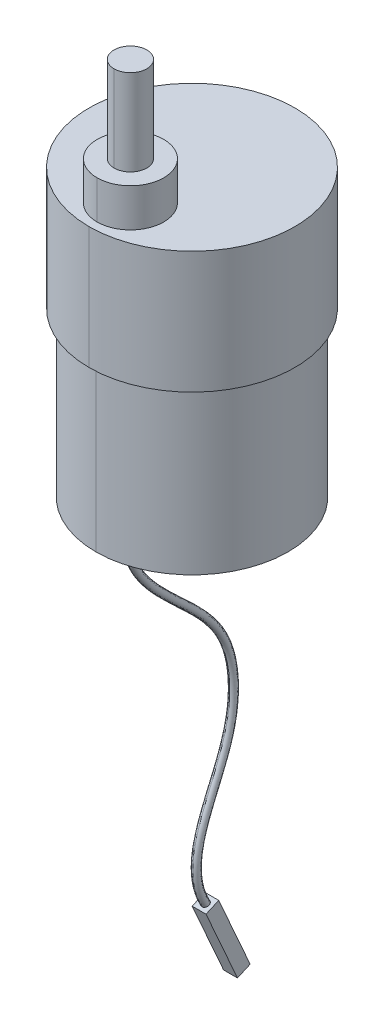
ISO-10303-21;
HEADER;
FILE_DESCRIPTION(('STEP AP214'),'2;1');
FILE_NAME('part.step','',(''),(''),'','','');
FILE_SCHEMA(('AUTOMOTIVE_DESIGN { 1 0 10303 214 1 1 1 1 }'));
ENDSEC;
DATA;
#1=APPLICATION_CONTEXT('core data for automotive mechanical design processes');
#2=APPLICATION_PROTOCOL_DEFINITION('international standard','automotive_design',2000,#1);
#3=PRODUCT_CONTEXT('',#1,'mechanical');
#4=PRODUCT('Part','Part','',(#3));
#5=PRODUCT_RELATED_PRODUCT_CATEGORY('part','',(#4));
#6=PRODUCT_DEFINITION_FORMATION('','',#4);
#7=PRODUCT_DEFINITION_CONTEXT('part definition',#1,'design');
#8=PRODUCT_DEFINITION('design','',#6,#7);
#9=PRODUCT_DEFINITION_SHAPE('','',#8);
#10=(LENGTH_UNIT() NAMED_UNIT(*) SI_UNIT(.MILLI.,.METRE.));
#11=(NAMED_UNIT(*) PLANE_ANGLE_UNIT() SI_UNIT($,.RADIAN.));
#12=(NAMED_UNIT(*) SI_UNIT($,.STERADIAN.) SOLID_ANGLE_UNIT());
#13=UNCERTAINTY_MEASURE_WITH_UNIT(LENGTH_MEASURE(1.E-05),#10,'distance_accuracy_value','');
#14=(GEOMETRIC_REPRESENTATION_CONTEXT(3) GLOBAL_UNCERTAINTY_ASSIGNED_CONTEXT((#13)) GLOBAL_UNIT_ASSIGNED_CONTEXT((#10,
#11,#12)) REPRESENTATION_CONTEXT('',''));
#15=CARTESIAN_POINT('',(0.,0.,0.));
#16=DIRECTION('',(0.,0.,1.));
#17=DIRECTION('',(1.,0.,0.));
#18=AXIS2_PLACEMENT_3D('',#15,#16,#17);
#19=CARTESIAN_POINT('',(0.,-55.0147326261418,-24.3537346097616));
#20=DIRECTION('',(0.,-0.914410504016221,-0.404788129945532));
#21=DIRECTION('',(0.,0.404788129945532,-0.914410504016221));
#22=AXIS2_PLACEMENT_3D('',#19,#20,#21);
#23=PLANE('',#22);
#24=CARTESIAN_POINT('',(0.,-64.7223606920733,-2.42434385967983));
#25=DIRECTION('',(0.,-0.914410504016226,-0.40478812994552));
#26=DIRECTION('',(0.,0.40478812994552,-0.914410504016226));
#27=AXIS2_PLACEMENT_3D('',#24,#25,#26);
#28=CIRCLE('',#27,0.65);
#29=CARTESIAN_POINT('',(0.,-64.4592484076087,-3.01871068729037));
#30=VERTEX_POINT('',#29);
#31=CARTESIAN_POINT('',(0.,-64.9854729765379,-1.82997703206929));
#32=VERTEX_POINT('',#31);
#33=EDGE_CURVE('E256',#30,#32,#28,.T.);
#34=ORIENTED_EDGE('',*,*,#33,.T.);
#35=CARTESIAN_POINT('',(0.,-64.7223606920733,-2.42434385967983));
#36=DIRECTION('',(0.,-0.914410504016226,-0.40478812994552));
#37=DIRECTION('',(0.,0.40478812994552,-0.914410504016226));
#38=AXIS2_PLACEMENT_3D('',#35,#36,#37);
#39=CIRCLE('',#38,0.65);
#40=EDGE_CURVE('E140',#32,#30,#39,.T.);
#41=ORIENTED_EDGE('',*,*,#40,.T.);
#42=EDGE_LOOP('',(#34,#41));
#43=FACE_BOUND('',#42,.T.);
#44=DIRECTION('',(-1.,0.,0.));
#45=VECTOR('',#44,1.);
#46=CARTESIAN_POINT('',(1.25,-65.2283458545052,-1.28133072965957));
#47=LINE('',#46,#45);
#48=CARTESIAN_POINT('',(1.25,-65.2283458545052,-1.28133072965957));
#49=VERTEX_POINT('',#48);
#50=CARTESIAN_POINT('',(-1.25,-65.2283458545052,-1.28133072965957));
#51=VERTEX_POINT('',#50);
#52=EDGE_CURVE('E207',#49,#51,#47,.T.);
#53=ORIENTED_EDGE('',*,*,#52,.F.);
#54=DIRECTION('',(0.,-0.404788129945532,0.914410504016221));
#55=VECTOR('',#54,1.);
#56=CARTESIAN_POINT('',(1.25,-64.2163755296414,-3.56735698970013));
#57=LINE('',#56,#55);
#58=CARTESIAN_POINT('',(1.25,-64.2163755296414,-3.56735698970013));
#59=VERTEX_POINT('',#58);
#60=EDGE_CURVE('E28',#59,#49,#57,.T.);
#61=ORIENTED_EDGE('',*,*,#60,.F.);
#62=DIRECTION('',(1.,0.,0.));
#63=VECTOR('',#62,1.);
#64=CARTESIAN_POINT('',(-1.25,-64.2163755296414,-3.56735698970013));
#65=LINE('',#64,#63);
#66=CARTESIAN_POINT('',(-1.25,-64.2163755296414,-3.56735698970013));
#67=VERTEX_POINT('',#66);
#68=EDGE_CURVE('E250',#67,#59,#65,.T.);
#69=ORIENTED_EDGE('',*,*,#68,.F.);
#70=DIRECTION('',(0.,0.404788129945532,-0.914410504016221));
#71=VECTOR('',#70,1.);
#72=CARTESIAN_POINT('',(-1.25,-65.2283458545052,-1.28133072965957));
#73=LINE('',#72,#71);
#74=EDGE_CURVE('E221',#51,#67,#73,.T.);
#75=ORIENTED_EDGE('',*,*,#74,.F.);
#76=EDGE_LOOP('',(#53,#61,#69,#75));
#77=FACE_BOUND('',#76,.T.);
#78=ADVANCED_FACE('F15',(#43,#77),#23,.F.);
#79=CARTESIAN_POINT('',(0.,-67.8164796823689,-30.020768428999));
#80=DIRECTION('',(0.,-0.914410504016221,-0.404788129945532));
#81=DIRECTION('',(0.,0.404788129945532,-0.914410504016221));
#82=AXIS2_PLACEMENT_3D('',#79,#80,#81);
#83=PLANE('',#82);
#84=DIRECTION('',(-1.,0.,0.));
#85=VECTOR('',#84,1.);
#86=CARTESIAN_POINT('',(1.25,-78.0300929107323,-6.94836454889697));
#87=LINE('',#86,#85);
#88=CARTESIAN_POINT('',(1.25,-78.0300929107323,-6.94836454889697));
#89=VERTEX_POINT('',#88);
#90=CARTESIAN_POINT('',(-1.25,-78.0300929107323,-6.94836454889697));
#91=VERTEX_POINT('',#90);
#92=EDGE_CURVE('E269',#89,#91,#87,.T.);
#93=ORIENTED_EDGE('',*,*,#92,.T.);
#94=DIRECTION('',(0.,0.404788129945532,-0.914410504016221));
#95=VECTOR('',#94,1.);
#96=CARTESIAN_POINT('',(-1.25,-78.0300929107323,-6.94836454889697));
#97=LINE('',#96,#95);
#98=CARTESIAN_POINT('',(-1.25,-77.0181225858685,-9.23439080893753));
#99=VERTEX_POINT('',#98);
#100=EDGE_CURVE('E232',#91,#99,#97,.T.);
#101=ORIENTED_EDGE('',*,*,#100,.T.);
#102=DIRECTION('',(1.,0.,0.));
#103=VECTOR('',#102,1.);
#104=CARTESIAN_POINT('',(-1.25,-77.0181225858685,-9.23439080893753));
#105=LINE('',#104,#103);
#106=CARTESIAN_POINT('',(1.25,-77.0181225858685,-9.23439080893753));
#107=VERTEX_POINT('',#106);
#108=EDGE_CURVE('E21',#99,#107,#105,.T.);
#109=ORIENTED_EDGE('',*,*,#108,.T.);
#110=DIRECTION('',(0.,-0.404788129945532,0.914410504016221));
#111=VECTOR('',#110,1.);
#112=CARTESIAN_POINT('',(1.25,-77.0181225858685,-9.23439080893753));
#113=LINE('',#112,#111);
#114=EDGE_CURVE('E10',#107,#89,#113,.T.);
#115=ORIENTED_EDGE('',*,*,#114,.T.);
#116=EDGE_LOOP('',(#93,#101,#109,#115));
#117=FACE_BOUND('',#116,.T.);
#118=ADVANCED_FACE('F348',(#117),#83,.T.);
#119=CARTESIAN_POINT('',(1.25,-77.0181225858685,-9.23439080893753));
#120=DIRECTION('',(-1.,0.,0.));
#121=DIRECTION('',(0.,0.,1.));
#122=AXIS2_PLACEMENT_3D('',#119,#120,#121);
#123=PLANE('',#122);
#124=ORIENTED_EDGE('',*,*,#60,.T.);
#125=DIRECTION('',(0.,0.914410504016222,0.404788129945528));
#126=VECTOR('',#125,1.);
#127=CARTESIAN_POINT('',(1.25,-78.0300929107323,-6.94836454889697));
#128=LINE('',#127,#126);
#129=EDGE_CURVE('E226',#89,#49,#128,.T.);
#130=ORIENTED_EDGE('',*,*,#129,.F.);
#131=ORIENTED_EDGE('',*,*,#114,.F.);
#132=DIRECTION('',(0.,0.914410504016222,0.404788129945528));
#133=VECTOR('',#132,1.);
#134=CARTESIAN_POINT('',(1.25,-77.0181225858685,-9.23439080893753));
#135=LINE('',#134,#133);
#136=EDGE_CURVE('E270',#107,#59,#135,.T.);
#137=ORIENTED_EDGE('',*,*,#136,.T.);
#138=EDGE_LOOP('',(#124,#130,#131,#137));
#139=FACE_BOUND('',#138,.T.);
#140=ADVANCED_FACE('F354',(#139),#123,.F.);
#141=CARTESIAN_POINT('',(-1.25,-77.0181225858685,-9.23439080893753));
#142=DIRECTION('',(0.,-0.404788129945528,0.914410504016222));
#143=DIRECTION('',(-1.,0.,0.));
#144=AXIS2_PLACEMENT_3D('',#141,#142,#143);
#145=PLANE('',#144);
#146=ORIENTED_EDGE('',*,*,#68,.T.);
#147=ORIENTED_EDGE('',*,*,#136,.F.);
#148=ORIENTED_EDGE('',*,*,#108,.F.);
#149=DIRECTION('',(0.,0.914410504016222,0.404788129945528));
#150=VECTOR('',#149,1.);
#151=CARTESIAN_POINT('',(-1.25,-77.0181225858685,-9.23439080893753));
#152=LINE('',#151,#150);
#153=EDGE_CURVE('E225',#99,#67,#152,.T.);
#154=ORIENTED_EDGE('',*,*,#153,.T.);
#155=EDGE_LOOP('',(#146,#147,#148,#154));
#156=FACE_BOUND('',#155,.T.);
#157=ADVANCED_FACE('F570',(#156),#145,.F.);
#158=CARTESIAN_POINT('',(-1.25,-78.0300929107323,-6.94836454889697));
#159=DIRECTION('',(1.,0.,0.));
#160=DIRECTION('',(0.,0.,1.));
#161=AXIS2_PLACEMENT_3D('',#158,#159,#160);
#162=PLANE('',#161);
#163=ORIENTED_EDGE('',*,*,#74,.T.);
#164=ORIENTED_EDGE('',*,*,#153,.F.);
#165=ORIENTED_EDGE('',*,*,#100,.F.);
#166=DIRECTION('',(0.,0.914410504016222,0.404788129945528));
#167=VECTOR('',#166,1.);
#168=CARTESIAN_POINT('',(-1.25,-78.0300929107323,-6.94836454889697));
#169=LINE('',#168,#167);
#170=EDGE_CURVE('E211',#91,#51,#169,.T.);
#171=ORIENTED_EDGE('',*,*,#170,.T.);
#172=EDGE_LOOP('',(#163,#164,#165,#171));
#173=FACE_BOUND('',#172,.T.);
#174=ADVANCED_FACE('F382',(#173),#162,.F.);
#175=CARTESIAN_POINT('',(1.25,-78.0300929107323,-6.94836454889697));
#176=DIRECTION('',(0.,0.404788129945528,-0.914410504016222));
#177=DIRECTION('',(-1.,0.,0.));
#178=AXIS2_PLACEMENT_3D('',#175,#176,#177);
#179=PLANE('',#178);
#180=ORIENTED_EDGE('',*,*,#52,.T.);
#181=ORIENTED_EDGE('',*,*,#170,.F.);
#182=ORIENTED_EDGE('',*,*,#92,.F.);
#183=ORIENTED_EDGE('',*,*,#129,.T.);
#184=EDGE_LOOP('',(#180,#181,#182,#183));
#185=FACE_BOUND('',#184,.T.);
#186=ADVANCED_FACE('F369',(#185),#179,.F.);
#187=CARTESIAN_POINT('',(0.,0.,12.65));
#188=CARTESIAN_POINT('',(0.,-2.94508597447817,12.4221320995553));
#189=CARTESIAN_POINT('',(0.,-5.4510477209894,11.4643707065353));
#190=CARTESIAN_POINT('',(0.,-9.86280286559184,8.73518139959936));
#191=CARTESIAN_POINT('',(0.,-11.7739584150813,6.96988376922254));
#192=CARTESIAN_POINT('',(0.,-17.2037332541465,1.40262029181695));
#193=CARTESIAN_POINT('',(0.,-20.4365862628114,-2.65453861440402));
#194=CARTESIAN_POINT('',(0.,-28.8274141781325,-6.94249034266679));
#195=CARTESIAN_POINT('',(0.,-34.1326729879684,-7.31428293315415));
#196=CARTESIAN_POINT('',(0.,-43.4025857579736,-5.14712333658673));
#197=CARTESIAN_POINT('',(0.,-47.5323174776611,-2.86793592251471));
#198=CARTESIAN_POINT('',(0.,-53.8521649333888,-0.675203239836204));
#199=CARTESIAN_POINT('',(0.,-55.9866849765013,-0.150542574307158));
#200=CARTESIAN_POINT('',(0.,-60.3947273715979,-0.098549934723846));
#201=CARTESIAN_POINT('',(0.,-62.6646128417333,-0.580780996059781));
#202=CARTESIAN_POINT('',(0.,-64.9854729765379,-1.82997703206929));
#203=CARTESIAN_POINT('',(-1.3,0.,12.65));
#204=CARTESIAN_POINT('',(-1.3,-2.94508597447817,12.4221320995553));
#205=CARTESIAN_POINT('',(-1.3,-5.45104772098939,11.4643707065353));
#206=CARTESIAN_POINT('',(-1.3,-9.86280286559183,8.73518139959935));
#207=CARTESIAN_POINT('',(-1.3,-11.7739584150813,6.96988376922255));
#208=CARTESIAN_POINT('',(-1.3,-17.2037332541465,1.40262029181695));
#209=CARTESIAN_POINT('',(-1.3,-20.4365862628114,-2.65453861440402));
#210=CARTESIAN_POINT('',(-1.3,-28.8274141781325,-6.94249034266678));
#211=CARTESIAN_POINT('',(-1.3,-34.1326729879684,-7.31428293315415));
#212=CARTESIAN_POINT('',(-1.3,-43.4025857579736,-5.14712333658673));
#213=CARTESIAN_POINT('',(-1.3,-47.5323174776611,-2.86793592251471));
#214=CARTESIAN_POINT('',(-1.3,-53.8521649333887,-0.675203239836204));
#215=CARTESIAN_POINT('',(-1.3,-55.9866849765013,-0.150542574307158));
#216=CARTESIAN_POINT('',(-1.3,-60.3947273715979,-0.0985499347238459));
#217=CARTESIAN_POINT('',(-1.3,-62.6646128417332,-0.58078099605978));
#218=CARTESIAN_POINT('',(-1.3,-64.9854729765379,-1.82997703206929));
#219=CARTESIAN_POINT('',(-1.3,0.,11.35));
#220=CARTESIAN_POINT('',(-1.3,-2.72297593374063,11.1221320993654));
#221=CARTESIAN_POINT('',(-1.3,-5.00215693324374,10.2331416397973));
#222=CARTESIAN_POINT('',(-1.3,-9.11955441032927,7.65582525360883));
#223=CARTESIAN_POINT('',(-1.3,-10.9524087292984,5.96136903183279));
#224=CARTESIAN_POINT('',(-1.3,-16.2800223976183,0.483413186728767));
#225=CARTESIAN_POINT('',(-1.3,-19.5859068972608,-3.71085119959601));
#226=CARTESIAN_POINT('',(-1.3,-28.6874121097851,-8.29004479228079));
#227=CARTESIAN_POINT('',(-1.3,-34.2758885455149,-8.63404704726913));
#228=CARTESIAN_POINT('',(-1.3,-44.0308335983493,-6.31042850093244));
#229=CARTESIAN_POINT('',(-1.3,-48.2019362741022,-3.99388933417028));
#230=CARTESIAN_POINT('',(-1.3,-54.2995445510352,-1.8984740934069));
#231=CARTESIAN_POINT('',(-1.3,-56.2985437731357,-1.4279924247951));
#232=CARTESIAN_POINT('',(-1.3,-60.3124856434885,-1.41094100634713));
#233=CARTESIAN_POINT('',(-1.3,-62.3310651711934,-1.85480820556681));
#234=CARTESIAN_POINT('',(-1.3,-64.4592484076086,-3.01871068729037));
#235=CARTESIAN_POINT('',(0.,0.,11.35));
#236=CARTESIAN_POINT('',(0.,-2.72297593374063,11.1221320993654));
#237=CARTESIAN_POINT('',(0.,-5.00215693324374,10.2331416397973));
#238=CARTESIAN_POINT('',(0.,-9.11955441032927,7.65582525360884));
#239=CARTESIAN_POINT('',(0.,-10.9524087292985,5.9613690318328));
#240=CARTESIAN_POINT('',(0.,-16.2800223976183,0.483413186728767));
#241=CARTESIAN_POINT('',(0.,-19.5859068972608,-3.710851199596));
#242=CARTESIAN_POINT('',(0.,-28.6874121097851,-8.2900447922808));
#243=CARTESIAN_POINT('',(0.,-34.275888545515,-8.63404704726914));
#244=CARTESIAN_POINT('',(0.,-44.0308335983493,-6.31042850093243));
#245=CARTESIAN_POINT('',(0.,-48.2019362741023,-3.99388933417028));
#246=CARTESIAN_POINT('',(0.,-54.2995445510352,-1.8984740934069));
#247=CARTESIAN_POINT('',(0.,-56.2985437731357,-1.4279924247951));
#248=CARTESIAN_POINT('',(0.,-60.3124856434886,-1.41094100634713));
#249=CARTESIAN_POINT('',(0.,-62.3310651711935,-1.8548082055668));
#250=CARTESIAN_POINT('',(0.,-64.4592484076087,-3.01871068729037));
#251=(BOUNDED_SURFACE() B_SPLINE_SURFACE(3,3,((#187,#188,#189,#190,#191,#192,#193,#194,#195,
#196,#197,#198,#199,#200,#201,#202),(#203,#204,#205,#206,#207,#208,#209,#210,#211,#212,#213,
#214,#215,#216,#217,#218),(#219,#220,#221,#222,#223,#224,#225,#226,#227,#228,#229,#230,#231,
#232,#233,#234),(#235,#236,#237,#238,#239,#240,#241,#242,#243,#244,#245,#246,#247,#248,#249,
#250)),.UNSPECIFIED.,.F.,.F.,.F.) B_SPLINE_SURFACE_WITH_KNOTS((4,4),(4,2,2,2,2,2,2,4),(0.5,1.),
(0.,0.105175367804045,0.210350735608091,0.420701471216182,0.628255178213897,0.814127589106948,
0.907063794553474,1.),
.UNSPECIFIED.) GEOMETRIC_REPRESENTATION_ITEM() RATIONAL_B_SPLINE_SURFACE(((1.,1.,1.,1.,1.,1.,1.,
1.,1.,1.,1.,1.,1.,1.,1.,1.),(0.333333333333334,0.333333333333334,0.333333333333334,
0.333333333333334,0.333333333333334,0.333333333333334,0.333333333333334,0.333333333333334,
0.333333333333334,0.333333333333334,0.333333333333334,0.333333333333334,0.333333333333334,
0.333333333333334,0.333333333333334,0.333333333333334),(0.333333333333334,0.333333333333334,
0.333333333333334,0.333333333333334,0.333333333333334,0.333333333333334,0.333333333333334,
0.333333333333334,0.333333333333334,0.333333333333334,0.333333333333334,0.333333333333334,
0.333333333333334,0.333333333333334,0.333333333333334,0.333333333333334),(1.,1.,1.,1.,1.,1.,1.,
1.,1.,1.,1.,1.,1.,1.,1.,1.))) REPRESENTATION_ITEM('') SURFACE());
#252=CARTESIAN_POINT('',(0.,0.,12.65));
#253=CARTESIAN_POINT('',(0.,-2.94508597447817,12.4221320995553));
#254=CARTESIAN_POINT('',(0.,-5.4510477209894,11.4643707065353));
#255=CARTESIAN_POINT('',(0.,-9.86280286559184,8.73518139959936));
#256=CARTESIAN_POINT('',(0.,-11.7739584150813,6.96988376922254));
#257=CARTESIAN_POINT('',(0.,-17.2037332541465,1.40262029181695));
#258=CARTESIAN_POINT('',(0.,-20.4365862628114,-2.65453861440402));
#259=CARTESIAN_POINT('',(0.,-28.8274141781325,-6.94249034266679));
#260=CARTESIAN_POINT('',(0.,-34.1326729879684,-7.31428293315415));
#261=CARTESIAN_POINT('',(0.,-43.4025857579736,-5.14712333658673));
#262=CARTESIAN_POINT('',(0.,-47.5323174776611,-2.86793592251471));
#263=CARTESIAN_POINT('',(0.,-53.8521649333888,-0.675203239836204));
#264=CARTESIAN_POINT('',(0.,-55.9866849765013,-0.150542574307158));
#265=CARTESIAN_POINT('',(0.,-60.3947273715979,-0.098549934723846));
#266=CARTESIAN_POINT('',(0.,-62.6646128417333,-0.580780996059781));
#267=CARTESIAN_POINT('',(0.,-64.9854729765379,-1.82997703206929));
#268=(BOUNDED_CURVE() B_SPLINE_CURVE(3,(#252,#253,#254,#255,#256,#257,#258,#259,#260,#261,#262,
#263,#264,#265,#266,#267),.UNSPECIFIED.,.F.,.F.) B_SPLINE_CURVE_WITH_KNOTS((4,2,2,2,2,2,2,4),
(0.,0.105175367804045,0.210350735608091,0.420701471216182,0.628255178213897,0.814127589106948,
0.907063794553474,1.),
.UNSPECIFIED.) CURVE() GEOMETRIC_REPRESENTATION_ITEM() RATIONAL_B_SPLINE_CURVE((1.,1.,1.,1.,1.,
1.,1.,1.,1.,1.,1.,1.,1.,1.,1.,1.)) REPRESENTATION_ITEM(''));
#269=CARTESIAN_POINT('',(0.,0.,12.65));
#270=VERTEX_POINT('',#269);
#271=EDGE_CURVE('E251',#270,#32,#268,.T.);
#272=CARTESIAN_POINT('',(0.,0.,12.));
#273=DIRECTION('',(0.,-1.,0.));
#274=DIRECTION('',(0.,0.,-1.));
#275=AXIS2_PLACEMENT_3D('',#272,#273,#274);
#276=CIRCLE('',#275,0.65);
#277=CARTESIAN_POINT('',(0.,0.,11.35));
#278=VERTEX_POINT('',#277);
#279=EDGE_CURVE('E151',#270,#278,#276,.T.);
#280=CARTESIAN_POINT('',(0.,0.,11.35));
#281=CARTESIAN_POINT('',(0.,-2.72297593374063,11.1221320993654));
#282=CARTESIAN_POINT('',(0.,-5.00215693324374,10.2331416397973));
#283=CARTESIAN_POINT('',(0.,-9.11955441032927,7.65582525360884));
#284=CARTESIAN_POINT('',(0.,-10.9524087292985,5.9613690318328));
#285=CARTESIAN_POINT('',(0.,-16.2800223976183,0.483413186728767));
#286=CARTESIAN_POINT('',(0.,-19.5859068972608,-3.710851199596));
#287=CARTESIAN_POINT('',(0.,-28.6874121097851,-8.2900447922808));
#288=CARTESIAN_POINT('',(0.,-34.275888545515,-8.63404704726914));
#289=CARTESIAN_POINT('',(0.,-44.0308335983493,-6.31042850093243));
#290=CARTESIAN_POINT('',(0.,-48.2019362741023,-3.99388933417028));
#291=CARTESIAN_POINT('',(0.,-54.2995445510352,-1.8984740934069));
#292=CARTESIAN_POINT('',(0.,-56.2985437731357,-1.4279924247951));
#293=CARTESIAN_POINT('',(0.,-60.3124856434886,-1.41094100634713));
#294=CARTESIAN_POINT('',(0.,-62.3310651711935,-1.8548082055668));
#295=CARTESIAN_POINT('',(0.,-64.4592484076087,-3.01871068729037));
#296=(BOUNDED_CURVE() B_SPLINE_CURVE(3,(#280,#281,#282,#283,#284,#285,#286,#287,#288,#289,#290,
#291,#292,#293,#294,#295),.UNSPECIFIED.,.F.,.F.) B_SPLINE_CURVE_WITH_KNOTS((4,2,2,2,2,2,2,4),
(0.,0.105175367804045,0.210350735608091,0.420701471216182,0.628255178213897,0.814127589106948,
0.907063794553474,1.),
.UNSPECIFIED.) CURVE() GEOMETRIC_REPRESENTATION_ITEM() RATIONAL_B_SPLINE_CURVE((1.,1.,1.,1.,1.,
1.,1.,1.,1.,1.,1.,1.,1.,1.,1.,1.)) REPRESENTATION_ITEM(''));
#297=EDGE_CURVE('E265',#278,#30,#296,.T.);
#298=ORIENTED_EDGE('',*,*,#271,.F.);
#299=ORIENTED_EDGE('',*,*,#279,.T.);
#300=ORIENTED_EDGE('',*,*,#297,.T.);
#301=ORIENTED_EDGE('',*,*,#40,.F.);
#302=EDGE_LOOP('',(#298,#299,#300,#301));
#303=FACE_BOUND('',#302,.T.);
#304=ADVANCED_FACE('F364',(#303),#251,.T.);
#305=CARTESIAN_POINT('',(0.,73.8,11.1));
#306=DIRECTION('',(0.,1.,0.));
#307=DIRECTION('',(1.,0.,0.));
#308=AXIS2_PLACEMENT_3D('',#305,#306,#307);
#309=PLANE('',#308);
#310=CARTESIAN_POINT('',(0.,73.8,11.1));
#311=DIRECTION('',(0.,1.,0.));
#312=DIRECTION('',(0.,0.,1.));
#313=AXIS2_PLACEMENT_3D('',#310,#311,#312);
#314=CIRCLE('',#313,2.95);
#315=CARTESIAN_POINT('',(0.,73.8,8.15));
#316=VERTEX_POINT('',#315);
#317=CARTESIAN_POINT('',(0.,73.8,14.05));
#318=VERTEX_POINT('',#317);
#319=EDGE_CURVE('E220',#316,#318,#314,.T.);
#320=ORIENTED_EDGE('',*,*,#319,.T.);
#321=CARTESIAN_POINT('',(0.,73.8,11.1));
#322=DIRECTION('',(0.,1.,0.));
#323=DIRECTION('',(0.,0.,1.));
#324=AXIS2_PLACEMENT_3D('',#321,#322,#323);
#325=CIRCLE('',#324,2.95);
#326=EDGE_CURVE('E237',#318,#316,#325,.T.);
#327=ORIENTED_EDGE('',*,*,#326,.T.);
#328=EDGE_LOOP('',(#320,#327));
#329=FACE_BOUND('',#328,.T.);
#330=ADVANCED_FACE('F368',(#329),#309,.T.);
#331=CARTESIAN_POINT('',(0.,73.8,11.1));
#332=DIRECTION('',(0.,-1.,0.));
#333=DIRECTION('',(0.,0.,-1.));
#334=AXIS2_PLACEMENT_3D('',#331,#332,#333);
#335=CYLINDRICAL_SURFACE('',#334,2.95);
#336=DIRECTION('',(0.,-1.,0.));
#337=VECTOR('',#336,1.);
#338=CARTESIAN_POINT('',(0.,73.8,14.05));
#339=LINE('',#338,#337);
#340=CARTESIAN_POINT('',(0.,58.3,14.05));
#341=VERTEX_POINT('',#340);
#342=EDGE_CURVE('E233',#318,#341,#339,.T.);
#343=ORIENTED_EDGE('',*,*,#342,.F.);
#344=ORIENTED_EDGE('',*,*,#319,.F.);
#345=DIRECTION('',(0.,-1.,0.));
#346=VECTOR('',#345,1.);
#347=CARTESIAN_POINT('',(0.,73.8,8.15));
#348=LINE('',#347,#346);
#349=CARTESIAN_POINT('',(0.,58.3,8.15));
#350=VERTEX_POINT('',#349);
#351=EDGE_CURVE('E196',#316,#350,#348,.T.);
#352=ORIENTED_EDGE('',*,*,#351,.T.);
#353=CARTESIAN_POINT('',(0.,58.3,11.1));
#354=DIRECTION('',(0.,1.,0.));
#355=DIRECTION('',(0.,0.,1.));
#356=AXIS2_PLACEMENT_3D('',#353,#354,#355);
#357=CIRCLE('',#356,2.95);
#358=EDGE_CURVE('E217',#350,#341,#357,.T.);
#359=ORIENTED_EDGE('',*,*,#358,.T.);
#360=EDGE_LOOP('',(#343,#344,#352,#359));
#361=FACE_BOUND('',#360,.T.);
#362=ADVANCED_FACE('F379',(#361),#335,.T.);
#363=CARTESIAN_POINT('',(0.,58.3,11.1));
#364=DIRECTION('',(0.,1.,0.));
#365=DIRECTION('',(1.,0.,0.));
#366=AXIS2_PLACEMENT_3D('',#363,#364,#365);
#367=PLANE('',#366);
#368=ORIENTED_EDGE('',*,*,#358,.F.);
#369=CARTESIAN_POINT('',(0.,58.3,11.1));
#370=DIRECTION('',(0.,1.,0.));
#371=DIRECTION('',(0.,0.,1.));
#372=AXIS2_PLACEMENT_3D('',#369,#370,#371);
#373=CIRCLE('',#372,2.95);
#374=EDGE_CURVE('E236',#341,#350,#373,.T.);
#375=ORIENTED_EDGE('',*,*,#374,.F.);
#376=EDGE_LOOP('',(#368,#375));
#377=FACE_BOUND('',#376,.T.);
#378=CARTESIAN_POINT('',(0.,58.3,11.1));
#379=DIRECTION('',(0.,1.,0.));
#380=DIRECTION('',(0.,0.,1.));
#381=AXIS2_PLACEMENT_3D('',#378,#379,#380);
#382=CIRCLE('',#381,6.);
#383=CARTESIAN_POINT('',(0.,58.3,5.1));
#384=VERTEX_POINT('',#383);
#385=CARTESIAN_POINT('',(0.,58.3,17.1));
#386=VERTEX_POINT('',#385);
#387=EDGE_CURVE('E215',#384,#386,#382,.T.);
#388=ORIENTED_EDGE('',*,*,#387,.T.);
#389=CARTESIAN_POINT('',(0.,58.3,11.1));
#390=DIRECTION('',(0.,1.,0.));
#391=DIRECTION('',(0.,0.,1.));
#392=AXIS2_PLACEMENT_3D('',#389,#390,#391);
#393=CIRCLE('',#392,6.);
#394=EDGE_CURVE('E198',#386,#384,#393,.T.);
#395=ORIENTED_EDGE('',*,*,#394,.T.);
#396=EDGE_LOOP('',(#388,#395));
#397=FACE_BOUND('',#396,.T.);
#398=ADVANCED_FACE('F360',(#377,#397),#367,.T.);
#399=CARTESIAN_POINT('',(0.,58.3,11.1));
#400=DIRECTION('',(0.,-1.,0.));
#401=DIRECTION('',(0.,0.,-1.));
#402=AXIS2_PLACEMENT_3D('',#399,#400,#401);
#403=CYLINDRICAL_SURFACE('',#402,6.);
#404=DIRECTION('',(0.,-1.,0.));
#405=VECTOR('',#404,1.);
#406=CARTESIAN_POINT('',(0.,58.3,17.1));
#407=LINE('',#406,#405);
#408=CARTESIAN_POINT('',(0.,51.4,17.1));
#409=VERTEX_POINT('',#408);
#410=EDGE_CURVE('E201',#386,#409,#407,.T.);
#411=ORIENTED_EDGE('',*,*,#410,.F.);
#412=ORIENTED_EDGE('',*,*,#387,.F.);
#413=DIRECTION('',(0.,-1.,0.));
#414=VECTOR('',#413,1.);
#415=CARTESIAN_POINT('',(0.,58.3,5.1));
#416=LINE('',#415,#414);
#417=CARTESIAN_POINT('',(0.,51.4,5.1));
#418=VERTEX_POINT('',#417);
#419=EDGE_CURVE('E206',#384,#418,#416,.T.);
#420=ORIENTED_EDGE('',*,*,#419,.T.);
#421=CARTESIAN_POINT('',(0.,51.4,11.1));
#422=DIRECTION('',(0.,1.,0.));
#423=DIRECTION('',(0.,0.,1.));
#424=AXIS2_PLACEMENT_3D('',#421,#422,#423);
#425=CIRCLE('',#424,6.);
#426=EDGE_CURVE('E212',#418,#409,#425,.T.);
#427=ORIENTED_EDGE('',*,*,#426,.T.);
#428=EDGE_LOOP('',(#411,#412,#420,#427));
#429=FACE_BOUND('',#428,.T.);
#430=ADVANCED_FACE('F343',(#429),#403,.T.);
#431=CARTESIAN_POINT('',(0.,29.4,0.));
#432=DIRECTION('',(0.,1.,0.));
#433=DIRECTION('',(1.,0.,0.));
#434=AXIS2_PLACEMENT_3D('',#431,#432,#433);
#435=PLANE('',#434);
#436=CARTESIAN_POINT('',(0.,29.4,0.));
#437=DIRECTION('',(0.,1.,0.));
#438=DIRECTION('',(0.,0.,1.));
#439=AXIS2_PLACEMENT_3D('',#436,#437,#438);
#440=CIRCLE('',#439,17.325);
#441=CARTESIAN_POINT('',(0.,29.4,-17.325));
#442=VERTEX_POINT('',#441);
#443=CARTESIAN_POINT('',(0.,29.4,17.325));
#444=VERTEX_POINT('',#443);
#445=EDGE_CURVE('E159',#442,#444,#440,.T.);
#446=ORIENTED_EDGE('',*,*,#445,.T.);
#447=CARTESIAN_POINT('',(0.,29.4,0.));
#448=DIRECTION('',(0.,1.,0.));
#449=DIRECTION('',(0.,0.,1.));
#450=AXIS2_PLACEMENT_3D('',#447,#448,#449);
#451=CIRCLE('',#450,17.325);
#452=EDGE_CURVE('E174',#444,#442,#451,.T.);
#453=ORIENTED_EDGE('',*,*,#452,.T.);
#454=EDGE_LOOP('',(#446,#453));
#455=FACE_BOUND('',#454,.T.);
#456=CARTESIAN_POINT('',(0.,29.4,0.));
#457=DIRECTION('',(0.,1.,0.));
#458=DIRECTION('',(0.,0.,1.));
#459=AXIS2_PLACEMENT_3D('',#456,#457,#458);
#460=CIRCLE('',#459,18.55);
#461=CARTESIAN_POINT('',(0.,29.4,-18.55));
#462=VERTEX_POINT('',#461);
#463=CARTESIAN_POINT('',(0.,29.4,18.55));
#464=VERTEX_POINT('',#463);
#465=EDGE_CURVE('E216',#462,#464,#460,.T.);
#466=ORIENTED_EDGE('',*,*,#465,.F.);
#467=CARTESIAN_POINT('',(0.,29.4,0.));
#468=DIRECTION('',(0.,1.,0.));
#469=DIRECTION('',(0.,0.,1.));
#470=AXIS2_PLACEMENT_3D('',#467,#468,#469);
#471=CIRCLE('',#470,18.55);
#472=EDGE_CURVE('E192',#464,#462,#471,.T.);
#473=ORIENTED_EDGE('',*,*,#472,.F.);
#474=EDGE_LOOP('',(#466,#473));
#475=FACE_BOUND('',#474,.T.);
#476=ADVANCED_FACE('F179',(#455,#475),#435,.F.);
#477=CARTESIAN_POINT('',(0.,51.4,0.));
#478=DIRECTION('',(0.,1.,0.));
#479=DIRECTION('',(1.,0.,0.));
#480=AXIS2_PLACEMENT_3D('',#477,#478,#479);
#481=PLANE('',#480);
#482=ORIENTED_EDGE('',*,*,#426,.F.);
#483=CARTESIAN_POINT('',(0.,51.4,11.1));
#484=DIRECTION('',(0.,1.,0.));
#485=DIRECTION('',(0.,0.,1.));
#486=AXIS2_PLACEMENT_3D('',#483,#484,#485);
#487=CIRCLE('',#486,6.);
#488=EDGE_CURVE('E202',#409,#418,#487,.T.);
#489=ORIENTED_EDGE('',*,*,#488,.F.);
#490=EDGE_LOOP('',(#482,#489));
#491=FACE_BOUND('',#490,.T.);
#492=CARTESIAN_POINT('',(0.,51.4,0.));
#493=DIRECTION('',(0.,1.,0.));
#494=DIRECTION('',(0.,0.,1.));
#495=AXIS2_PLACEMENT_3D('',#492,#493,#494);
#496=CIRCLE('',#495,18.55);
#497=CARTESIAN_POINT('',(0.,51.4,-18.55));
#498=VERTEX_POINT('',#497);
#499=CARTESIAN_POINT('',(0.,51.4,18.55));
#500=VERTEX_POINT('',#499);
#501=EDGE_CURVE('E239',#498,#500,#496,.T.);
#502=ORIENTED_EDGE('',*,*,#501,.T.);
#503=CARTESIAN_POINT('',(0.,51.4,0.));
#504=DIRECTION('',(0.,1.,0.));
#505=DIRECTION('',(0.,0.,1.));
#506=AXIS2_PLACEMENT_3D('',#503,#504,#505);
#507=CIRCLE('',#506,18.55);
#508=EDGE_CURVE('E280',#500,#498,#507,.T.);
#509=ORIENTED_EDGE('',*,*,#508,.T.);
#510=EDGE_LOOP('',(#502,#509));
#511=FACE_BOUND('',#510,.T.);
#512=ADVANCED_FACE('F332',(#491,#511),#481,.T.);
#513=CARTESIAN_POINT('',(0.,51.4,0.));
#514=DIRECTION('',(0.,-1.,0.));
#515=DIRECTION('',(0.,0.,-1.));
#516=AXIS2_PLACEMENT_3D('',#513,#514,#515);
#517=CYLINDRICAL_SURFACE('',#516,18.55);
#518=DIRECTION('',(0.,-1.,0.));
#519=VECTOR('',#518,1.);
#520=CARTESIAN_POINT('',(0.,51.4,18.55));
#521=LINE('',#520,#519);
#522=EDGE_CURVE('E276',#500,#464,#521,.T.);
#523=ORIENTED_EDGE('',*,*,#522,.F.);
#524=ORIENTED_EDGE('',*,*,#501,.F.);
#525=DIRECTION('',(0.,-1.,0.));
#526=VECTOR('',#525,1.);
#527=CARTESIAN_POINT('',(0.,51.4,-18.55));
#528=LINE('',#527,#526);
#529=EDGE_CURVE('E182',#498,#462,#528,.T.);
#530=ORIENTED_EDGE('',*,*,#529,.T.);
#531=ORIENTED_EDGE('',*,*,#465,.T.);
#532=EDGE_LOOP('',(#523,#524,#530,#531));
#533=FACE_BOUND('',#532,.T.);
#534=ADVANCED_FACE('F326',(#533),#517,.T.);
#535=CARTESIAN_POINT('',(0.,0.,0.));
#536=DIRECTION('',(0.,1.,0.));
#537=DIRECTION('',(1.,0.,0.));
#538=AXIS2_PLACEMENT_3D('',#535,#536,#537);
#539=PLANE('',#538);
#540=CARTESIAN_POINT('',(0.,0.,12.));
#541=DIRECTION('',(0.,-1.,0.));
#542=DIRECTION('',(0.,0.,-1.));
#543=AXIS2_PLACEMENT_3D('',#540,#541,#542);
#544=CIRCLE('',#543,0.65);
#545=EDGE_CURVE('E257',#278,#270,#544,.T.);
#546=ORIENTED_EDGE('',*,*,#545,.F.);
#547=ORIENTED_EDGE('',*,*,#279,.F.);
#548=EDGE_LOOP('',(#546,#547));
#549=FACE_BOUND('',#548,.T.);
#550=CARTESIAN_POINT('',(0.,0.,0.));
#551=DIRECTION('',(0.,1.,0.));
#552=DIRECTION('',(0.,0.,1.));
#553=AXIS2_PLACEMENT_3D('',#550,#551,#552);
#554=CIRCLE('',#553,17.325);
#555=CARTESIAN_POINT('',(0.,0.,-17.325));
#556=VERTEX_POINT('',#555);
#557=CARTESIAN_POINT('',(0.,0.,17.325));
#558=VERTEX_POINT('',#557);
#559=EDGE_CURVE('E170',#556,#558,#554,.T.);
#560=ORIENTED_EDGE('',*,*,#559,.F.);
#561=CARTESIAN_POINT('',(0.,0.,0.));
#562=DIRECTION('',(0.,1.,0.));
#563=DIRECTION('',(0.,0.,1.));
#564=AXIS2_PLACEMENT_3D('',#561,#562,#563);
#565=CIRCLE('',#564,17.325);
#566=EDGE_CURVE('E176',#558,#556,#565,.T.);
#567=ORIENTED_EDGE('',*,*,#566,.F.);
#568=EDGE_LOOP('',(#560,#567));
#569=FACE_BOUND('',#568,.T.);
#570=ADVANCED_FACE('F341',(#549,#569),#539,.F.);
#571=CARTESIAN_POINT('',(0.,29.4,0.));
#572=DIRECTION('',(0.,-1.,0.));
#573=DIRECTION('',(0.,0.,-1.));
#574=AXIS2_PLACEMENT_3D('',#571,#572,#573);
#575=CYLINDRICAL_SURFACE('',#574,17.325);
#576=DIRECTION('',(0.,-1.,0.));
#577=VECTOR('',#576,1.);
#578=CARTESIAN_POINT('',(0.,29.4,17.325));
#579=LINE('',#578,#577);
#580=EDGE_CURVE('E165',#444,#558,#579,.T.);
#581=ORIENTED_EDGE('',*,*,#580,.F.);
#582=ORIENTED_EDGE('',*,*,#445,.F.);
#583=DIRECTION('',(0.,-1.,0.));
#584=VECTOR('',#583,1.);
#585=CARTESIAN_POINT('',(0.,29.4,-17.325));
#586=LINE('',#585,#584);
#587=EDGE_CURVE('E162',#442,#556,#586,.T.);
#588=ORIENTED_EDGE('',*,*,#587,.T.);
#589=ORIENTED_EDGE('',*,*,#559,.T.);
#590=EDGE_LOOP('',(#581,#582,#588,#589));
#591=FACE_BOUND('',#590,.T.);
#592=ADVANCED_FACE('F161',(#591),#575,.T.);
#593=CARTESIAN_POINT('',(0.,29.4,0.));
#594=DIRECTION('',(0.,-1.,0.));
#595=DIRECTION('',(0.,0.,-1.));
#596=AXIS2_PLACEMENT_3D('',#593,#594,#595);
#597=CYLINDRICAL_SURFACE('',#596,17.325);
#598=ORIENTED_EDGE('',*,*,#452,.F.);
#599=ORIENTED_EDGE('',*,*,#580,.T.);
#600=ORIENTED_EDGE('',*,*,#566,.T.);
#601=ORIENTED_EDGE('',*,*,#587,.F.);
#602=EDGE_LOOP('',(#598,#599,#600,#601));
#603=FACE_BOUND('',#602,.T.);
#604=ADVANCED_FACE('F173',(#603),#597,.T.);
#605=CARTESIAN_POINT('',(0.,51.4,0.));
#606=DIRECTION('',(0.,-1.,0.));
#607=DIRECTION('',(0.,0.,-1.));
#608=AXIS2_PLACEMENT_3D('',#605,#606,#607);
#609=CYLINDRICAL_SURFACE('',#608,18.55);
#610=ORIENTED_EDGE('',*,*,#508,.F.);
#611=ORIENTED_EDGE('',*,*,#522,.T.);
#612=ORIENTED_EDGE('',*,*,#472,.T.);
#613=ORIENTED_EDGE('',*,*,#529,.F.);
#614=EDGE_LOOP('',(#610,#611,#612,#613));
#615=FACE_BOUND('',#614,.T.);
#616=ADVANCED_FACE('F330',(#615),#609,.T.);
#617=CARTESIAN_POINT('',(0.,58.3,11.1));
#618=DIRECTION('',(0.,-1.,0.));
#619=DIRECTION('',(0.,0.,-1.));
#620=AXIS2_PLACEMENT_3D('',#617,#618,#619);
#621=CYLINDRICAL_SURFACE('',#620,6.);
#622=ORIENTED_EDGE('',*,*,#394,.F.);
#623=ORIENTED_EDGE('',*,*,#410,.T.);
#624=ORIENTED_EDGE('',*,*,#488,.T.);
#625=ORIENTED_EDGE('',*,*,#419,.F.);
#626=EDGE_LOOP('',(#622,#623,#624,#625));
#627=FACE_BOUND('',#626,.T.);
#628=ADVANCED_FACE('F525',(#627),#621,.T.);
#629=CARTESIAN_POINT('',(0.,73.8,11.1));
#630=DIRECTION('',(0.,-1.,0.));
#631=DIRECTION('',(0.,0.,-1.));
#632=AXIS2_PLACEMENT_3D('',#629,#630,#631);
#633=CYLINDRICAL_SURFACE('',#632,2.95);
#634=ORIENTED_EDGE('',*,*,#326,.F.);
#635=ORIENTED_EDGE('',*,*,#342,.T.);
#636=ORIENTED_EDGE('',*,*,#374,.T.);
#637=ORIENTED_EDGE('',*,*,#351,.F.);
#638=EDGE_LOOP('',(#634,#635,#636,#637));
#639=FACE_BOUND('',#638,.T.);
#640=ADVANCED_FACE('F533',(#639),#633,.T.);
#641=CARTESIAN_POINT('',(0.,0.,11.35));
#642=CARTESIAN_POINT('',(0.,-2.72297593374063,11.1221320993654));
#643=CARTESIAN_POINT('',(0.,-5.00215693324374,10.2331416397973));
#644=CARTESIAN_POINT('',(0.,-9.11955441032927,7.65582525360884));
#645=CARTESIAN_POINT('',(0.,-10.9524087292985,5.9613690318328));
#646=CARTESIAN_POINT('',(0.,-16.2800223976183,0.483413186728767));
#647=CARTESIAN_POINT('',(0.,-19.5859068972608,-3.710851199596));
#648=CARTESIAN_POINT('',(0.,-28.6874121097851,-8.2900447922808));
#649=CARTESIAN_POINT('',(0.,-34.275888545515,-8.63404704726914));
#650=CARTESIAN_POINT('',(0.,-44.0308335983493,-6.31042850093243));
#651=CARTESIAN_POINT('',(0.,-48.2019362741023,-3.99388933417028));
#652=CARTESIAN_POINT('',(0.,-54.2995445510352,-1.8984740934069));
#653=CARTESIAN_POINT('',(0.,-56.2985437731357,-1.4279924247951));
#654=CARTESIAN_POINT('',(0.,-60.3124856434886,-1.41094100634713));
#655=CARTESIAN_POINT('',(0.,-62.3310651711935,-1.8548082055668));
#656=CARTESIAN_POINT('',(0.,-64.4592484076087,-3.01871068729037));
#657=CARTESIAN_POINT('',(1.3,0.,11.35));
#658=CARTESIAN_POINT('',(1.3,-2.72297593374063,11.1221320993654));
#659=CARTESIAN_POINT('',(1.3,-5.00215693324374,10.2331416397973));
#660=CARTESIAN_POINT('',(1.3,-9.11955441032927,7.65582525360883));
#661=CARTESIAN_POINT('',(1.3,-10.9524087292984,5.96136903183279));
#662=CARTESIAN_POINT('',(1.3,-16.2800223976183,0.483413186728767));
#663=CARTESIAN_POINT('',(1.3,-19.5859068972608,-3.71085119959601));
#664=CARTESIAN_POINT('',(1.3,-28.6874121097851,-8.29004479228079));
#665=CARTESIAN_POINT('',(1.3,-34.2758885455149,-8.63404704726913));
#666=CARTESIAN_POINT('',(1.3,-44.0308335983493,-6.31042850093244));
#667=CARTESIAN_POINT('',(1.3,-48.2019362741022,-3.99388933417028));
#668=CARTESIAN_POINT('',(1.3,-54.2995445510352,-1.8984740934069));
#669=CARTESIAN_POINT('',(1.3,-56.2985437731357,-1.4279924247951));
#670=CARTESIAN_POINT('',(1.3,-60.3124856434885,-1.41094100634713));
#671=CARTESIAN_POINT('',(1.3,-62.3310651711934,-1.85480820556681));
#672=CARTESIAN_POINT('',(1.3,-64.4592484076086,-3.01871068729037));
#673=CARTESIAN_POINT('',(1.3,0.,12.65));
#674=CARTESIAN_POINT('',(1.3,-2.94508597447817,12.4221320995553));
#675=CARTESIAN_POINT('',(1.3,-5.45104772098939,11.4643707065353));
#676=CARTESIAN_POINT('',(1.3,-9.86280286559183,8.73518139959935));
#677=CARTESIAN_POINT('',(1.3,-11.7739584150813,6.96988376922255));
#678=CARTESIAN_POINT('',(1.3,-17.2037332541465,1.40262029181695));
#679=CARTESIAN_POINT('',(1.3,-20.4365862628114,-2.65453861440402));
#680=CARTESIAN_POINT('',(1.3,-28.8274141781325,-6.94249034266678));
#681=CARTESIAN_POINT('',(1.3,-34.1326729879684,-7.31428293315415));
#682=CARTESIAN_POINT('',(1.3,-43.4025857579736,-5.14712333658673));
#683=CARTESIAN_POINT('',(1.3,-47.5323174776611,-2.86793592251471));
#684=CARTESIAN_POINT('',(1.3,-53.8521649333887,-0.675203239836204));
#685=CARTESIAN_POINT('',(1.3,-55.9866849765013,-0.150542574307158));
#686=CARTESIAN_POINT('',(1.3,-60.3947273715979,-0.0985499347238459));
#687=CARTESIAN_POINT('',(1.3,-62.6646128417332,-0.58078099605978));
#688=CARTESIAN_POINT('',(1.3,-64.9854729765379,-1.82997703206929));
#689=CARTESIAN_POINT('',(0.,0.,12.65));
#690=CARTESIAN_POINT('',(0.,-2.94508597447817,12.4221320995553));
#691=CARTESIAN_POINT('',(0.,-5.4510477209894,11.4643707065353));
#692=CARTESIAN_POINT('',(0.,-9.86280286559184,8.73518139959936));
#693=CARTESIAN_POINT('',(0.,-11.7739584150813,6.96988376922254));
#694=CARTESIAN_POINT('',(0.,-17.2037332541465,1.40262029181695));
#695=CARTESIAN_POINT('',(0.,-20.4365862628114,-2.65453861440402));
#696=CARTESIAN_POINT('',(0.,-28.8274141781325,-6.94249034266679));
#697=CARTESIAN_POINT('',(0.,-34.1326729879684,-7.31428293315415));
#698=CARTESIAN_POINT('',(0.,-43.4025857579736,-5.14712333658673));
#699=CARTESIAN_POINT('',(0.,-47.5323174776611,-2.86793592251471));
#700=CARTESIAN_POINT('',(0.,-53.8521649333888,-0.675203239836204));
#701=CARTESIAN_POINT('',(0.,-55.9866849765013,-0.150542574307158));
#702=CARTESIAN_POINT('',(0.,-60.3947273715979,-0.098549934723846));
#703=CARTESIAN_POINT('',(0.,-62.6646128417333,-0.580780996059781));
#704=CARTESIAN_POINT('',(0.,-64.9854729765379,-1.82997703206929));
#705=(BOUNDED_SURFACE() B_SPLINE_SURFACE(3,3,((#641,#642,#643,#644,#645,#646,#647,#648,#649,
#650,#651,#652,#653,#654,#655,#656),(#657,#658,#659,#660,#661,#662,#663,#664,#665,#666,#667,
#668,#669,#670,#671,#672),(#673,#674,#675,#676,#677,#678,#679,#680,#681,#682,#683,#684,#685,
#686,#687,#688),(#689,#690,#691,#692,#693,#694,#695,#696,#697,#698,#699,#700,#701,#702,#703,
#704)),.UNSPECIFIED.,.F.,.F.,.F.) B_SPLINE_SURFACE_WITH_KNOTS((4,4),(4,2,2,2,2,2,2,4),(0.,0.5),
(0.,0.105175367804045,0.210350735608091,0.420701471216182,0.628255178213897,0.814127589106948,
0.907063794553474,1.),
.UNSPECIFIED.) GEOMETRIC_REPRESENTATION_ITEM() RATIONAL_B_SPLINE_SURFACE(((1.,1.,1.,1.,1.,1.,1.,
1.,1.,1.,1.,1.,1.,1.,1.,1.),(0.333333333333334,0.333333333333334,0.333333333333334,
0.333333333333334,0.333333333333334,0.333333333333334,0.333333333333334,0.333333333333334,
0.333333333333334,0.333333333333334,0.333333333333334,0.333333333333334,0.333333333333334,
0.333333333333334,0.333333333333334,0.333333333333334),(0.333333333333334,0.333333333333334,
0.333333333333334,0.333333333333334,0.333333333333334,0.333333333333334,0.333333333333334,
0.333333333333334,0.333333333333334,0.333333333333334,0.333333333333334,0.333333333333334,
0.333333333333334,0.333333333333334,0.333333333333334,0.333333333333334),(1.,1.,1.,1.,1.,1.,1.,
1.,1.,1.,1.,1.,1.,1.,1.,1.))) REPRESENTATION_ITEM('') SURFACE());
#706=ORIENTED_EDGE('',*,*,#545,.T.);
#707=ORIENTED_EDGE('',*,*,#271,.T.);
#708=ORIENTED_EDGE('',*,*,#33,.F.);
#709=ORIENTED_EDGE('',*,*,#297,.F.);
#710=EDGE_LOOP('',(#706,#707,#708,#709));
#711=FACE_BOUND('',#710,.T.);
#712=ADVANCED_FACE('F17',(#711),#705,.T.);
#713=CLOSED_SHELL('',(#78,#118,#140,#157,#174,#186,#304,#330,#362,#398,#430,#476,#512,#534,#570,
#592,#604,#616,#628,#640,#712));
#714=MANIFOLD_SOLID_BREP('B1',#713);
#715=ADVANCED_BREP_SHAPE_REPRESENTATION('',(#18,#714),#14);
#716=SHAPE_DEFINITION_REPRESENTATION(#9,#715);
ENDSEC;
END-ISO-10303-21;
